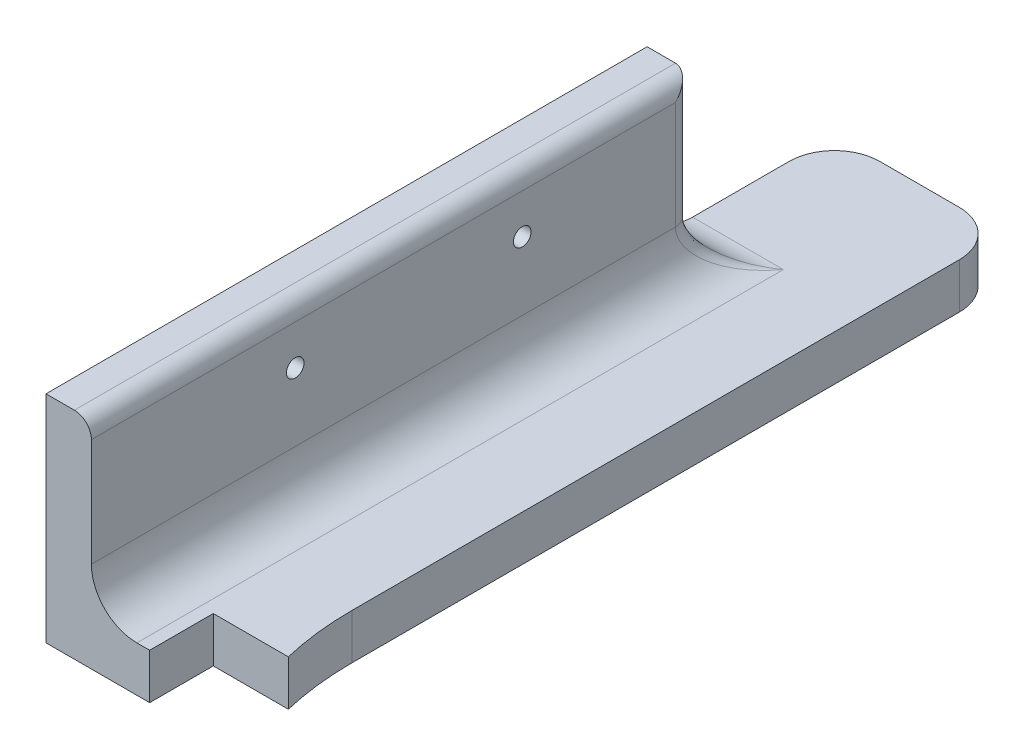
ISO-10303-21;
HEADER;
FILE_DESCRIPTION(('STEP AP214'),'2;1');
FILE_NAME('part.step','',(''),(''),'','','');
FILE_SCHEMA(('AUTOMOTIVE_DESIGN { 1 0 10303 214 1 1 1 1 }'));
ENDSEC;
DATA;
#1=APPLICATION_CONTEXT('core data for automotive mechanical design processes');
#2=APPLICATION_PROTOCOL_DEFINITION('international standard','automotive_design',2000,#1);
#3=PRODUCT_CONTEXT('',#1,'mechanical');
#4=PRODUCT('Part','Part','',(#3));
#5=PRODUCT_RELATED_PRODUCT_CATEGORY('part','',(#4));
#6=PRODUCT_DEFINITION_FORMATION('','',#4);
#7=PRODUCT_DEFINITION_CONTEXT('part definition',#1,'design');
#8=PRODUCT_DEFINITION('design','',#6,#7);
#9=PRODUCT_DEFINITION_SHAPE('','',#8);
#10=(LENGTH_UNIT() NAMED_UNIT(*) SI_UNIT(.MILLI.,.METRE.));
#11=(NAMED_UNIT(*) PLANE_ANGLE_UNIT() SI_UNIT($,.RADIAN.));
#12=(NAMED_UNIT(*) SI_UNIT($,.STERADIAN.) SOLID_ANGLE_UNIT());
#13=UNCERTAINTY_MEASURE_WITH_UNIT(LENGTH_MEASURE(1.E-05),#10,'distance_accuracy_value','');
#14=(GEOMETRIC_REPRESENTATION_CONTEXT(3) GLOBAL_UNCERTAINTY_ASSIGNED_CONTEXT((#13)) GLOBAL_UNIT_ASSIGNED_CONTEXT((#10,
#11,#12)) REPRESENTATION_CONTEXT('',''));
#15=CARTESIAN_POINT('',(0.,0.,0.));
#16=DIRECTION('',(0.,0.,1.));
#17=DIRECTION('',(1.,0.,0.));
#18=AXIS2_PLACEMENT_3D('',#15,#16,#17);
#19=CARTESIAN_POINT('',(-11.7425866237553,-0.0100000000000031,-64.7941480597572));
#20=DIRECTION('',(0.,0.,1.));
#21=DIRECTION('',(1.,0.,0.));
#22=AXIS2_PLACEMENT_3D('',#19,#20,#21);
#23=PLANE('',#22);
#24=DIRECTION('',(0.,-1.,0.));
#25=VECTOR('',#24,1.);
#26=CARTESIAN_POINT('',(1.47737016907246,8.,-64.7941480597572));
#27=LINE('',#26,#25);
#28=CARTESIAN_POINT('',(1.47737016907246,0.,-64.7941480597572));
#29=VERTEX_POINT('',#28);
#30=CARTESIAN_POINT('',(1.47737016907246,8.,-64.7941480597572));
#31=VERTEX_POINT('',#30);
#32=EDGE_CURVE('E261',#29,#31,#27,.F.);
#33=ORIENTED_EDGE('',*,*,#32,.T.);
#34=DIRECTION('',(-1.,0.,0.));
#35=VECTOR('',#34,1.);
#36=CARTESIAN_POINT('',(55.,8.,-64.7941480597572));
#37=LINE('',#36,#35);
#38=CARTESIAN_POINT('',(-11.7425866237553,8.,-64.7941480597572));
#39=VERTEX_POINT('',#38);
#40=EDGE_CURVE('E255',#31,#39,#37,.T.);
#41=ORIENTED_EDGE('',*,*,#40,.T.);
#42=DIRECTION('',(0.,1.,0.));
#43=VECTOR('',#42,1.);
#44=CARTESIAN_POINT('',(-11.7425866237553,-0.0100000000000031,-64.7941480597572));
#45=LINE('',#44,#43);
#46=CARTESIAN_POINT('',(-11.7425866237553,0.,-64.7941480597572));
#47=VERTEX_POINT('',#46);
#48=EDGE_CURVE('E11',#47,#39,#45,.T.);
#49=ORIENTED_EDGE('',*,*,#48,.F.);
#50=DIRECTION('',(-1.,0.,0.));
#51=VECTOR('',#50,1.);
#52=CARTESIAN_POINT('',(55.,0.,-64.7941480597572));
#53=LINE('',#52,#51);
#54=EDGE_CURVE('E247',#29,#47,#53,.T.);
#55=ORIENTED_EDGE('',*,*,#54,.F.);
#56=EDGE_LOOP('',(#33,#41,#49,#55));
#57=FACE_BOUND('',#56,.T.);
#58=ADVANCED_FACE('F43',(#57),#23,.T.);
#59=CARTESIAN_POINT('',(-30.,-0.0100000000000031,-53.5798321691983));
#60=DIRECTION('',(0.,0.,1.));
#61=DIRECTION('',(1.,0.,0.));
#62=AXIS2_PLACEMENT_3D('',#59,#60,#61);
#63=PLANE('',#62);
#64=DIRECTION('',(-1.,0.,0.));
#65=VECTOR('',#64,1.);
#66=CARTESIAN_POINT('',(55.,0.,-53.5798321691983));
#67=LINE('',#66,#65);
#68=CARTESIAN_POINT('',(-11.7425866237553,0.,-53.5798321691983));
#69=VERTEX_POINT('',#68);
#70=CARTESIAN_POINT('',(-30.,0.,-53.5798321691983));
#71=VERTEX_POINT('',#70);
#72=EDGE_CURVE('E174',#69,#71,#67,.T.);
#73=ORIENTED_EDGE('',*,*,#72,.F.);
#74=DIRECTION('',(0.,1.,0.));
#75=VECTOR('',#74,1.);
#76=CARTESIAN_POINT('',(-11.7425866237553,-0.0100000000000031,-53.5798321691983));
#77=LINE('',#76,#75);
#78=CARTESIAN_POINT('',(-11.7425866237553,8.,-53.5798321691983));
#79=VERTEX_POINT('',#78);
#80=EDGE_CURVE('E52',#69,#79,#77,.T.);
#81=ORIENTED_EDGE('',*,*,#80,.T.);
#82=DIRECTION('',(-1.,0.,0.));
#83=VECTOR('',#82,1.);
#84=CARTESIAN_POINT('',(55.,8.,-53.5798321691983));
#85=LINE('',#84,#83);
#86=CARTESIAN_POINT('',(-14.,8.,-53.5798321691983));
#87=VERTEX_POINT('',#86);
#88=EDGE_CURVE('E158',#79,#87,#85,.T.);
#89=ORIENTED_EDGE('',*,*,#88,.T.);
#90=CARTESIAN_POINT('',(-14.,16.,-53.5798321691983));
#91=DIRECTION('',(0.,0.,1.));
#92=DIRECTION('',(1.,0.,0.));
#93=AXIS2_PLACEMENT_3D('',#90,#91,#92);
#94=CIRCLE('',#93,8.);
#95=CARTESIAN_POINT('',(-22.,16.,-53.5798321691983));
#96=VERTEX_POINT('',#95);
#97=EDGE_CURVE('E172',#87,#96,#94,.F.);
#98=ORIENTED_EDGE('',*,*,#97,.T.);
#99=DIRECTION('',(0.,1.,0.));
#100=VECTOR('',#99,1.);
#101=CARTESIAN_POINT('',(-22.,38.,-53.5798321691983));
#102=LINE('',#101,#100);
#103=CARTESIAN_POINT('',(-22.,35.,-53.5798321691983));
#104=VERTEX_POINT('',#103);
#105=EDGE_CURVE('E183',#96,#104,#102,.T.);
#106=ORIENTED_EDGE('',*,*,#105,.T.);
#107=CARTESIAN_POINT('',(-25.,35.,-53.5798321691983));
#108=DIRECTION('',(0.,0.,1.));
#109=DIRECTION('',(1.,0.,0.));
#110=AXIS2_PLACEMENT_3D('',#107,#108,#109);
#111=CIRCLE('',#110,3.);
#112=CARTESIAN_POINT('',(-25.,38.,-53.5798321691983));
#113=VERTEX_POINT('',#112);
#114=EDGE_CURVE('E190',#113,#104,#111,.F.);
#115=ORIENTED_EDGE('',*,*,#114,.F.);
#116=DIRECTION('',(-1.,0.,0.));
#117=VECTOR('',#116,1.);
#118=CARTESIAN_POINT('',(0.,38.,-53.5798321691983));
#119=LINE('',#118,#117);
#120=CARTESIAN_POINT('',(-30.,38.,-53.5798321691982));
#121=VERTEX_POINT('',#120);
#122=EDGE_CURVE('E180',#113,#121,#119,.T.);
#123=ORIENTED_EDGE('',*,*,#122,.T.);
#124=DIRECTION('',(0.,-1.,0.));
#125=VECTOR('',#124,1.);
#126=CARTESIAN_POINT('',(-30.,8.,-53.5798321691983));
#127=LINE('',#126,#125);
#128=EDGE_CURVE('E258',#121,#71,#127,.T.);
#129=ORIENTED_EDGE('',*,*,#128,.T.);
#130=EDGE_LOOP('',(#73,#81,#89,#98,#106,#115,#123,#129));
#131=FACE_BOUND('',#130,.T.);
#132=ADVANCED_FACE('F170',(#131),#63,.T.);
#133=CARTESIAN_POINT('',(-11.7425866237553,-0.0100000000000031,-53.5798321691983));
#134=DIRECTION('',(1.,0.,0.));
#135=DIRECTION('',(0.,0.,-1.));
#136=AXIS2_PLACEMENT_3D('',#133,#134,#135);
#137=PLANE('',#136);
#138=ORIENTED_EDGE('',*,*,#48,.T.);
#139=DIRECTION('',(0.,0.,1.));
#140=VECTOR('',#139,1.);
#141=CARTESIAN_POINT('',(-11.7425866237553,8.,-77.4562211910223));
#142=LINE('',#141,#140);
#143=EDGE_CURVE('E175',#39,#79,#142,.T.);
#144=ORIENTED_EDGE('',*,*,#143,.T.);
#145=ORIENTED_EDGE('',*,*,#80,.F.);
#146=DIRECTION('',(0.,0.,1.));
#147=VECTOR('',#146,1.);
#148=CARTESIAN_POINT('',(-11.7425866237553,0.,-77.4562211910223));
#149=LINE('',#148,#147);
#150=EDGE_CURVE('E250',#47,#69,#149,.T.);
#151=ORIENTED_EDGE('',*,*,#150,.F.);
#152=EDGE_LOOP('',(#138,#144,#145,#151));
#153=FACE_BOUND('',#152,.T.);
#154=ADVANCED_FACE('F320',(#153),#137,.T.);
#155=CARTESIAN_POINT('',(-30.,16.,-167.484069150193));
#156=DIRECTION('',(1.,0.,0.));
#157=DIRECTION('',(0.,0.,-1.));
#158=AXIS2_PLACEMENT_3D('',#155,#156,#157);
#159=CYLINDRICAL_SURFACE('',#158,8.);
#160=DIRECTION('',(-1.,0.,0.));
#161=VECTOR('',#160,1.);
#162=CARTESIAN_POINT('',(-30.,16.,-159.484069150193));
#163=LINE('',#162,#161);
#164=CARTESIAN_POINT('',(-25.,16.,-159.484069150193));
#165=VERTEX_POINT('',#164);
#166=CARTESIAN_POINT('',(-30.,16.,-159.484069150193));
#167=VERTEX_POINT('',#166);
#168=EDGE_CURVE('E165',#165,#167,#163,.T.);
#169=ORIENTED_EDGE('',*,*,#168,.F.);
#170=CARTESIAN_POINT('',(-14.,16.,-167.484069150193));
#171=DIRECTION('',(-0.588171697675047,0.,-0.808736084303188));
#172=DIRECTION('',(0.808736084303188,0.,-0.588171697675047));
#173=AXIS2_PLACEMENT_3D('',#170,#171,#172);
#174=ELLIPSE('',#173,13.6014705087354,8.);
#175=CARTESIAN_POINT('',(-14.,8.,-167.484069150193));
#176=VERTEX_POINT('',#175);
#177=EDGE_CURVE('E360',#165,#176,#174,.F.);
#178=ORIENTED_EDGE('',*,*,#177,.T.);
#179=DIRECTION('',(-1.,0.,0.));
#180=VECTOR('',#179,1.);
#181=CARTESIAN_POINT('',(-22.,8.,-167.484069150193));
#182=LINE('',#181,#180);
#183=CARTESIAN_POINT('',(-30.,8.,-167.484069150193));
#184=VERTEX_POINT('',#183);
#185=EDGE_CURVE('E161',#184,#176,#182,.F.);
#186=ORIENTED_EDGE('',*,*,#185,.F.);
#187=CARTESIAN_POINT('',(-30.,16.,-167.484069150193));
#188=DIRECTION('',(1.,0.,0.));
#189=DIRECTION('',(0.,0.,-1.));
#190=AXIS2_PLACEMENT_3D('',#187,#188,#189);
#191=CIRCLE('',#190,8.);
#192=EDGE_CURVE('E195',#167,#184,#191,.T.);
#193=ORIENTED_EDGE('',*,*,#192,.F.);
#194=EDGE_LOOP('',(#169,#178,#186,#193));
#195=FACE_BOUND('',#194,.T.);
#196=ADVANCED_FACE('F290',(#195),#159,.F.);
#197=CARTESIAN_POINT('',(55.,8.,-77.4562211910223));
#198=DIRECTION('',(0.,-1.,0.));
#199=DIRECTION('',(0.,0.,-1.));
#200=AXIS2_PLACEMENT_3D('',#197,#198,#199);
#201=CYLINDRICAL_SURFACE('',#200,55.);
#202=ORIENTED_EDGE('',*,*,#32,.F.);
#203=CARTESIAN_POINT('',(55.,0.,-77.4562211910223));
#204=DIRECTION('',(0.,-1.,0.));
#205=DIRECTION('',(0.,0.,-1.));
#206=AXIS2_PLACEMENT_3D('',#203,#204,#205);
#207=CIRCLE('',#206,55.);
#208=CARTESIAN_POINT('',(0.,0.,-77.4562211910223));
#209=VERTEX_POINT('',#208);
#210=EDGE_CURVE('E69',#29,#209,#207,.T.);
#211=ORIENTED_EDGE('',*,*,#210,.T.);
#212=DIRECTION('',(0.,-1.,0.));
#213=VECTOR('',#212,1.);
#214=CARTESIAN_POINT('',(0.,8.,-77.4562211910223));
#215=LINE('',#214,#213);
#216=CARTESIAN_POINT('',(0.,8.,-77.4562211910223));
#217=VERTEX_POINT('',#216);
#218=EDGE_CURVE('E200',#217,#209,#215,.T.);
#219=ORIENTED_EDGE('',*,*,#218,.F.);
#220=CARTESIAN_POINT('',(55.,8.,-77.4562211910223));
#221=DIRECTION('',(0.,-1.,0.));
#222=DIRECTION('',(0.,0.,-1.));
#223=AXIS2_PLACEMENT_3D('',#220,#221,#222);
#224=CIRCLE('',#223,55.);
#225=EDGE_CURVE('E197',#31,#217,#224,.T.);
#226=ORIENTED_EDGE('',*,*,#225,.F.);
#227=EDGE_LOOP('',(#202,#211,#219,#226));
#228=FACE_BOUND('',#227,.T.);
#229=ADVANCED_FACE('F306',(#228),#201,.F.);
#230=CARTESIAN_POINT('',(0.,8.,-192.484069150193));
#231=DIRECTION('',(-1.,0.,0.));
#232=DIRECTION('',(0.,0.,1.));
#233=AXIS2_PLACEMENT_3D('',#230,#231,#232);
#234=PLANE('',#233);
#235=DIRECTION('',(0.,0.,-1.));
#236=VECTOR('',#235,1.);
#237=CARTESIAN_POINT('',(0.,0.,-192.484069150193));
#238=LINE('',#237,#236);
#239=CARTESIAN_POINT('',(0.,0.,-184.484069150193));
#240=VERTEX_POINT('',#239);
#241=EDGE_CURVE('E212',#209,#240,#238,.T.);
#242=ORIENTED_EDGE('',*,*,#241,.T.);
#243=DIRECTION('',(0.,-1.,0.));
#244=VECTOR('',#243,1.);
#245=CARTESIAN_POINT('',(0.,8.,-184.484069150193));
#246=LINE('',#245,#244);
#247=CARTESIAN_POINT('',(0.,8.,-184.484069150193));
#248=VERTEX_POINT('',#247);
#249=EDGE_CURVE('E361',#240,#248,#246,.F.);
#250=ORIENTED_EDGE('',*,*,#249,.T.);
#251=DIRECTION('',(0.,0.,-1.));
#252=VECTOR('',#251,1.);
#253=CARTESIAN_POINT('',(0.,8.,-192.484069150193));
#254=LINE('',#253,#252);
#255=EDGE_CURVE('E204',#217,#248,#254,.T.);
#256=ORIENTED_EDGE('',*,*,#255,.F.);
#257=ORIENTED_EDGE('',*,*,#218,.T.);
#258=EDGE_LOOP('',(#242,#250,#256,#257));
#259=FACE_BOUND('',#258,.T.);
#260=ADVANCED_FACE('F309',(#259),#234,.F.);
#261=CARTESIAN_POINT('',(-8.,8.,-184.484069150193));
#262=DIRECTION('',(0.,-1.,0.));
#263=DIRECTION('',(0.,0.,-1.));
#264=AXIS2_PLACEMENT_3D('',#261,#262,#263);
#265=CYLINDRICAL_SURFACE('',#264,8.);
#266=CARTESIAN_POINT('',(-8.,8.,-184.484069150193));
#267=DIRECTION('',(0.,-1.,0.));
#268=DIRECTION('',(0.,0.,-1.));
#269=AXIS2_PLACEMENT_3D('',#266,#267,#268);
#270=CIRCLE('',#269,8.);
#271=CARTESIAN_POINT('',(-8.,8.,-192.484069150193));
#272=VERTEX_POINT('',#271);
#273=EDGE_CURVE('E373',#248,#272,#270,.F.);
#274=ORIENTED_EDGE('',*,*,#273,.F.);
#275=ORIENTED_EDGE('',*,*,#249,.F.);
#276=CARTESIAN_POINT('',(-8.,0.,-184.484069150193));
#277=DIRECTION('',(0.,-1.,0.));
#278=DIRECTION('',(0.,0.,-1.));
#279=AXIS2_PLACEMENT_3D('',#276,#277,#278);
#280=CIRCLE('',#279,8.);
#281=CARTESIAN_POINT('',(-8.,0.,-192.484069150193));
#282=VERTEX_POINT('',#281);
#283=EDGE_CURVE('E381',#282,#240,#280,.T.);
#284=ORIENTED_EDGE('',*,*,#283,.F.);
#285=DIRECTION('',(0.,-1.,0.));
#286=VECTOR('',#285,1.);
#287=CARTESIAN_POINT('',(-8.,8.,-192.484069150193));
#288=LINE('',#287,#286);
#289=EDGE_CURVE('E377',#272,#282,#288,.T.);
#290=ORIENTED_EDGE('',*,*,#289,.F.);
#291=EDGE_LOOP('',(#274,#275,#284,#290));
#292=FACE_BOUND('',#291,.T.);
#293=ADVANCED_FACE('F341',(#292),#265,.T.);
#294=CARTESIAN_POINT('',(0.,8.,-192.484069150193));
#295=DIRECTION('',(0.,0.,1.));
#296=DIRECTION('',(1.,0.,0.));
#297=AXIS2_PLACEMENT_3D('',#294,#295,#296);
#298=PLANE('',#297);
#299=DIRECTION('',(-1.,0.,0.));
#300=VECTOR('',#299,1.);
#301=CARTESIAN_POINT('',(0.,0.,-192.484069150193));
#302=LINE('',#301,#300);
#303=CARTESIAN_POINT('',(-22.,0.,-192.484069150193));
#304=VERTEX_POINT('',#303);
#305=EDGE_CURVE('E206',#282,#304,#302,.T.);
#306=ORIENTED_EDGE('',*,*,#305,.T.);
#307=DIRECTION('',(0.,-1.,0.));
#308=VECTOR('',#307,1.);
#309=CARTESIAN_POINT('',(-22.,8.,-192.484069150193));
#310=LINE('',#309,#308);
#311=CARTESIAN_POINT('',(-22.,8.,-192.484069150193));
#312=VERTEX_POINT('',#311);
#313=EDGE_CURVE('E375',#304,#312,#310,.F.);
#314=ORIENTED_EDGE('',*,*,#313,.T.);
#315=DIRECTION('',(-1.,0.,0.));
#316=VECTOR('',#315,1.);
#317=CARTESIAN_POINT('',(0.,8.,-192.484069150193));
#318=LINE('',#317,#316);
#319=EDGE_CURVE('E202',#272,#312,#318,.T.);
#320=ORIENTED_EDGE('',*,*,#319,.F.);
#321=ORIENTED_EDGE('',*,*,#289,.T.);
#322=EDGE_LOOP('',(#306,#314,#320,#321));
#323=FACE_BOUND('',#322,.T.);
#324=ADVANCED_FACE('F338',(#323),#298,.F.);
#325=CARTESIAN_POINT('',(-22.,8.,-184.484069150193));
#326=DIRECTION('',(0.,-1.,0.));
#327=DIRECTION('',(0.,0.,-1.));
#328=AXIS2_PLACEMENT_3D('',#325,#326,#327);
#329=CYLINDRICAL_SURFACE('',#328,8.);
#330=CARTESIAN_POINT('',(-22.,8.,-184.484069150193));
#331=DIRECTION('',(0.,-1.,0.));
#332=DIRECTION('',(0.,0.,-1.));
#333=AXIS2_PLACEMENT_3D('',#330,#331,#332);
#334=CIRCLE('',#333,8.);
#335=CARTESIAN_POINT('',(-30.,8.,-184.484069150193));
#336=VERTEX_POINT('',#335);
#337=EDGE_CURVE('E371',#312,#336,#334,.F.);
#338=ORIENTED_EDGE('',*,*,#337,.F.);
#339=ORIENTED_EDGE('',*,*,#313,.F.);
#340=CARTESIAN_POINT('',(-22.,0.,-184.484069150193));
#341=DIRECTION('',(0.,-1.,0.));
#342=DIRECTION('',(0.,0.,-1.));
#343=AXIS2_PLACEMENT_3D('',#340,#341,#342);
#344=CIRCLE('',#343,8.);
#345=CARTESIAN_POINT('',(-30.,0.,-184.484069150193));
#346=VERTEX_POINT('',#345);
#347=EDGE_CURVE('E379',#346,#304,#344,.T.);
#348=ORIENTED_EDGE('',*,*,#347,.F.);
#349=DIRECTION('',(0.,-1.,0.));
#350=VECTOR('',#349,1.);
#351=CARTESIAN_POINT('',(-30.,8.,-184.484069150193));
#352=LINE('',#351,#350);
#353=EDGE_CURVE('E382',#336,#346,#352,.T.);
#354=ORIENTED_EDGE('',*,*,#353,.F.);
#355=EDGE_LOOP('',(#338,#339,#348,#354));
#356=FACE_BOUND('',#355,.T.);
#357=ADVANCED_FACE('F330',(#356),#329,.T.);
#358=CARTESIAN_POINT('',(-30.,28.,-89.4840691501934));
#359=DIRECTION('',(1.,0.,0.));
#360=DIRECTION('',(0.,0.,-1.));
#361=AXIS2_PLACEMENT_3D('',#358,#359,#360);
#362=CYLINDRICAL_SURFACE('',#361,1.54999999999999);
#363=CARTESIAN_POINT('',(-30.,28.,-89.4840691501934));
#364=DIRECTION('',(1.,0.,0.));
#365=DIRECTION('',(0.,0.,-1.));
#366=AXIS2_PLACEMENT_3D('',#363,#364,#365);
#367=CIRCLE('',#366,1.54999999999999);
#368=CARTESIAN_POINT('',(-30.,28.,-91.0340691501934));
#369=VERTEX_POINT('',#368);
#370=EDGE_CURVE('E238',#369,#369,#367,.T.);
#371=ORIENTED_EDGE('',*,*,#370,.F.);
#372=EDGE_LOOP('',(#371));
#373=FACE_BOUND('',#372,.T.);
#374=CARTESIAN_POINT('',(-22.,28.,-89.4840691501934));
#375=DIRECTION('',(1.,0.,0.));
#376=DIRECTION('',(0.,0.,-1.));
#377=AXIS2_PLACEMENT_3D('',#374,#375,#376);
#378=CIRCLE('',#377,1.54999999999999);
#379=CARTESIAN_POINT('',(-22.,28.,-91.0340691501934));
#380=VERTEX_POINT('',#379);
#381=EDGE_CURVE('E241',#380,#380,#378,.T.);
#382=ORIENTED_EDGE('',*,*,#381,.T.);
#383=EDGE_LOOP('',(#382));
#384=FACE_BOUND('',#383,.T.);
#385=ADVANCED_FACE('F327',(#373,#384),#362,.F.);
#386=CARTESIAN_POINT('',(-30.,28.,-129.484069150193));
#387=DIRECTION('',(1.,0.,0.));
#388=DIRECTION('',(0.,0.,-1.));
#389=AXIS2_PLACEMENT_3D('',#386,#387,#388);
#390=CYLINDRICAL_SURFACE('',#389,1.54999999999999);
#391=CARTESIAN_POINT('',(-30.,28.,-129.484069150193));
#392=DIRECTION('',(1.,0.,0.));
#393=DIRECTION('',(0.,0.,-1.));
#394=AXIS2_PLACEMENT_3D('',#391,#392,#393);
#395=CIRCLE('',#394,1.54999999999999);
#396=CARTESIAN_POINT('',(-30.,28.,-131.034069150193));
#397=VERTEX_POINT('',#396);
#398=EDGE_CURVE('E231',#397,#397,#395,.T.);
#399=ORIENTED_EDGE('',*,*,#398,.F.);
#400=EDGE_LOOP('',(#399));
#401=FACE_BOUND('',#400,.T.);
#402=CARTESIAN_POINT('',(-22.,28.,-129.484069150193));
#403=DIRECTION('',(1.,0.,0.));
#404=DIRECTION('',(0.,0.,-1.));
#405=AXIS2_PLACEMENT_3D('',#402,#403,#404);
#406=CIRCLE('',#405,1.54999999999999);
#407=CARTESIAN_POINT('',(-22.,28.,-131.034069150193));
#408=VERTEX_POINT('',#407);
#409=EDGE_CURVE('E235',#408,#408,#406,.T.);
#410=ORIENTED_EDGE('',*,*,#409,.T.);
#411=EDGE_LOOP('',(#410));
#412=FACE_BOUND('',#411,.T.);
#413=ADVANCED_FACE('F314',(#401,#412),#390,.F.);
#414=CARTESIAN_POINT('',(-30.,8.,-192.484069150193));
#415=DIRECTION('',(1.,0.,0.));
#416=DIRECTION('',(0.,0.,-1.));
#417=AXIS2_PLACEMENT_3D('',#414,#415,#416);
#418=PLANE('',#417);
#419=ORIENTED_EDGE('',*,*,#398,.T.);
#420=EDGE_LOOP('',(#419));
#421=FACE_BOUND('',#420,.T.);
#422=ORIENTED_EDGE('',*,*,#370,.T.);
#423=EDGE_LOOP('',(#422));
#424=FACE_BOUND('',#423,.T.);
#425=ORIENTED_EDGE('',*,*,#128,.F.);
#426=DIRECTION('',(0.,0.,1.));
#427=VECTOR('',#426,1.);
#428=CARTESIAN_POINT('',(-30.,38.,20.5159308498065));
#429=LINE('',#428,#427);
#430=CARTESIAN_POINT('',(-30.,38.,-159.484069150193));
#431=VERTEX_POINT('',#430);
#432=EDGE_CURVE('E47',#431,#121,#429,.T.);
#433=ORIENTED_EDGE('',*,*,#432,.F.);
#434=DIRECTION('',(0.,-1.,0.));
#435=VECTOR('',#434,1.);
#436=CARTESIAN_POINT('',(-30.,38.,-159.484069150193));
#437=LINE('',#436,#435);
#438=EDGE_CURVE('E219',#431,#167,#437,.T.);
#439=ORIENTED_EDGE('',*,*,#438,.T.);
#440=ORIENTED_EDGE('',*,*,#192,.T.);
#441=DIRECTION('',(0.,0.,1.));
#442=VECTOR('',#441,1.);
#443=CARTESIAN_POINT('',(-30.,8.,-192.484069150193));
#444=LINE('',#443,#442);
#445=EDGE_CURVE('E199',#336,#184,#444,.T.);
#446=ORIENTED_EDGE('',*,*,#445,.F.);
#447=ORIENTED_EDGE('',*,*,#353,.T.);
#448=DIRECTION('',(0.,0.,1.));
#449=VECTOR('',#448,1.);
#450=CARTESIAN_POINT('',(-30.,0.,-192.484069150193));
#451=LINE('',#450,#449);
#452=EDGE_CURVE('E203',#346,#71,#451,.T.);
#453=ORIENTED_EDGE('',*,*,#452,.T.);
#454=EDGE_LOOP('',(#425,#433,#439,#440,#446,#447,#453));
#455=FACE_BOUND('',#454,.T.);
#456=ADVANCED_FACE('F310',(#421,#424,#455),#418,.F.);
#457=CARTESIAN_POINT('',(-30.,38.,-159.484069150193));
#458=DIRECTION('',(0.,0.,1.));
#459=DIRECTION('',(1.,0.,0.));
#460=AXIS2_PLACEMENT_3D('',#457,#458,#459);
#461=PLANE('',#460);
#462=DIRECTION('',(-1.,0.,0.));
#463=VECTOR('',#462,1.);
#464=CARTESIAN_POINT('',(-30.,38.,-159.484069150193));
#465=LINE('',#464,#463);
#466=CARTESIAN_POINT('',(-25.,38.,-159.484069150193));
#467=VERTEX_POINT('',#466);
#468=EDGE_CURVE('E60',#467,#431,#465,.T.);
#469=ORIENTED_EDGE('',*,*,#468,.F.);
#470=DIRECTION('',(0.,-1.,0.));
#471=VECTOR('',#470,1.);
#472=CARTESIAN_POINT('',(-25.,38.,-159.484069150193));
#473=LINE('',#472,#471);
#474=EDGE_CURVE('E194',#467,#165,#473,.T.);
#475=ORIENTED_EDGE('',*,*,#474,.T.);
#476=ORIENTED_EDGE('',*,*,#168,.T.);
#477=ORIENTED_EDGE('',*,*,#438,.F.);
#478=EDGE_LOOP('',(#469,#475,#476,#477));
#479=FACE_BOUND('',#478,.T.);
#480=ADVANCED_FACE('F313',(#479),#461,.F.);
#481=CARTESIAN_POINT('',(-25.,38.,-156.484069150193));
#482=DIRECTION('',(0.,-1.,0.));
#483=DIRECTION('',(0.,0.,-1.));
#484=AXIS2_PLACEMENT_3D('',#481,#482,#483);
#485=CYLINDRICAL_SURFACE('',#484,3.);
#486=CARTESIAN_POINT('',(-25.,35.,-156.484069150193));
#487=DIRECTION('',(0.,-0.707106781186547,-0.707106781186547));
#488=DIRECTION('',(0.,0.707106781186547,-0.707106781186547));
#489=AXIS2_PLACEMENT_3D('',#486,#487,#488);
#490=ELLIPSE('',#489,4.24264068711928,3.);
#491=CARTESIAN_POINT('',(-22.,35.,-156.484069150193));
#492=VERTEX_POINT('',#491);
#493=EDGE_CURVE('E234',#467,#492,#490,.T.);
#494=ORIENTED_EDGE('',*,*,#493,.T.);
#495=DIRECTION('',(0.,-1.,0.));
#496=VECTOR('',#495,1.);
#497=CARTESIAN_POINT('',(-22.,38.,-156.484069150193));
#498=LINE('',#497,#496);
#499=CARTESIAN_POINT('',(-22.,16.,-156.484069150193));
#500=VERTEX_POINT('',#499);
#501=EDGE_CURVE('E189',#500,#492,#498,.F.);
#502=ORIENTED_EDGE('',*,*,#501,.F.);
#503=CARTESIAN_POINT('',(-25.,16.,-156.484069150193));
#504=DIRECTION('',(0.,-1.,0.));
#505=DIRECTION('',(0.,0.,-1.));
#506=AXIS2_PLACEMENT_3D('',#503,#504,#505);
#507=CIRCLE('',#506,3.);
#508=EDGE_CURVE('E245',#165,#500,#507,.T.);
#509=ORIENTED_EDGE('',*,*,#508,.F.);
#510=ORIENTED_EDGE('',*,*,#474,.F.);
#511=EDGE_LOOP('',(#494,#502,#509,#510));
#512=FACE_BOUND('',#511,.T.);
#513=ADVANCED_FACE('F274',(#512),#485,.T.);
#514=CARTESIAN_POINT('',(-22.,38.,-159.484069150193));
#515=DIRECTION('',(-1.,0.,0.));
#516=DIRECTION('',(0.,0.,1.));
#517=AXIS2_PLACEMENT_3D('',#514,#515,#516);
#518=PLANE('',#517);
#519=ORIENTED_EDGE('',*,*,#409,.F.);
#520=EDGE_LOOP('',(#519));
#521=FACE_BOUND('',#520,.T.);
#522=ORIENTED_EDGE('',*,*,#381,.F.);
#523=EDGE_LOOP('',(#522));
#524=FACE_BOUND('',#523,.T.);
#525=ORIENTED_EDGE('',*,*,#105,.F.);
#526=DIRECTION('',(0.,0.,-1.));
#527=VECTOR('',#526,1.);
#528=CARTESIAN_POINT('',(-22.,16.,-159.484069150193));
#529=LINE('',#528,#527);
#530=EDGE_CURVE('E178',#96,#500,#529,.T.);
#531=ORIENTED_EDGE('',*,*,#530,.T.);
#532=ORIENTED_EDGE('',*,*,#501,.T.);
#533=DIRECTION('',(0.,0.,-1.));
#534=VECTOR('',#533,1.);
#535=CARTESIAN_POINT('',(-22.,35.,-159.484069150193));
#536=LINE('',#535,#534);
#537=EDGE_CURVE('E191',#492,#104,#536,.F.);
#538=ORIENTED_EDGE('',*,*,#537,.T.);
#539=EDGE_LOOP('',(#525,#531,#532,#538));
#540=FACE_BOUND('',#539,.T.);
#541=ADVANCED_FACE('F266',(#521,#524,#540),#518,.F.);
#542=CARTESIAN_POINT('',(0.,38.,0.));
#543=DIRECTION('',(0.,-1.,0.));
#544=DIRECTION('',(0.,0.,-1.));
#545=AXIS2_PLACEMENT_3D('',#542,#543,#544);
#546=PLANE('',#545);
#547=ORIENTED_EDGE('',*,*,#122,.F.);
#548=DIRECTION('',(0.,0.,-1.));
#549=VECTOR('',#548,1.);
#550=CARTESIAN_POINT('',(-25.,38.,0.));
#551=LINE('',#550,#549);
#552=EDGE_CURVE('E187',#113,#467,#551,.T.);
#553=ORIENTED_EDGE('',*,*,#552,.T.);
#554=ORIENTED_EDGE('',*,*,#468,.T.);
#555=ORIENTED_EDGE('',*,*,#432,.T.);
#556=EDGE_LOOP('',(#547,#553,#554,#555));
#557=FACE_BOUND('',#556,.T.);
#558=ADVANCED_FACE('F297',(#557),#546,.F.);
#559=CARTESIAN_POINT('',(-25.,35.,0.));
#560=DIRECTION('',(0.,0.,-1.));
#561=DIRECTION('',(-1.,0.,0.));
#562=AXIS2_PLACEMENT_3D('',#559,#560,#561);
#563=CYLINDRICAL_SURFACE('',#562,3.);
#564=ORIENTED_EDGE('',*,*,#552,.F.);
#565=ORIENTED_EDGE('',*,*,#114,.T.);
#566=ORIENTED_EDGE('',*,*,#537,.F.);
#567=ORIENTED_EDGE('',*,*,#493,.F.);
#568=EDGE_LOOP('',(#564,#565,#566,#567));
#569=FACE_BOUND('',#568,.T.);
#570=ADVANCED_FACE('F45',(#569),#563,.T.);
#571=CARTESIAN_POINT('',(-14.,24.,-167.484069150193));
#572=CARTESIAN_POINT('',(-14.,24.,-167.484069150193));
#573=CARTESIAN_POINT('',(-14.,24.,-167.484069150193));
#574=CARTESIAN_POINT('',(-14.1742938927822,23.9999899619562,-167.244415047618));
#575=CARTESIAN_POINT('',(-14.2069737710404,24.0000198148153,-167.277095379153));
#576=CARTESIAN_POINT('',(-14.2396541025755,23.9999899619562,-167.309775257411));
#577=CARTESIAN_POINT('',(-14.3485626460554,23.9943042150284,-167.004795511867));
#578=CARTESIAN_POINT('',(-14.4140647462828,23.9921609522811,-167.070004403911));
#579=CARTESIAN_POINT('',(-14.4792736383262,23.9943042150284,-167.135506504138));
#580=CARTESIAN_POINT('',(-14.6967405015425,23.9715136887388,-166.526050960572));
#581=CARTESIAN_POINT('',(-14.8271077874044,23.9608300694683,-166.656961362789));
#582=CARTESIAN_POINT('',(-14.9580181896209,23.9715136887388,-166.787328648651));
#583=CARTESIAN_POINT('',(-14.8706495725402,23.9544079568025,-166.286925987951));
#584=CARTESIAN_POINT('',(-15.0333526216844,23.9373121220661,-166.450716528509));
#585=CARTESIAN_POINT('',(-15.1971431622428,23.9544079568025,-166.613419577653));
#586=CARTESIAN_POINT('',(-15.3882720668425,23.8862632644301,-165.575195058285));
#587=CARTESIAN_POINT('',(-15.6463697288112,23.8436747706663,-165.837699421382));
#588=CARTESIAN_POINT('',(-15.9088740919084,23.8862632644301,-166.095797083351));
#589=CARTESIAN_POINT('',(-15.7309626636212,23.8183972142882,-165.103995487714));
#590=CARTESIAN_POINT('',(-16.0510809019746,23.7501713189761,-165.432988248219));
#591=CARTESIAN_POINT('',(-16.3800736624791,23.8183972142882,-165.753106486572));
#592=CARTESIAN_POINT('',(-16.4044461355066,23.6379421875901,-164.177955713872));
#593=CARTESIAN_POINT('',(-16.8373545599593,23.5044939880067,-164.646714590234));
#594=CARTESIAN_POINT('',(-17.3061134363215,23.6379421875901,-165.079623014687));
#595=CARTESIAN_POINT('',(-16.7353421607257,23.5261224395318,-163.722973679196));
#596=CARTESIAN_POINT('',(-17.2212349282761,23.3519662395429,-164.262834221917));
#597=CARTESIAN_POINT('',(-17.7610954709978,23.5261224395318,-164.748726989468));
#598=CARTESIAN_POINT('',(-17.3795588580707,23.2592778467988,-162.837175720346));
#599=CARTESIAN_POINT('',(-17.9559886493718,22.9936301666897,-163.528080500822));
#600=CARTESIAN_POINT('',(-18.6468934298472,23.2592778467988,-164.104510292123));
#601=CARTESIAN_POINT('',(-17.693111683002,23.105385191681,-162.406040586066));
#602=CARTESIAN_POINT('',(-18.3091044136777,22.7873013169734,-163.174964736516));
#603=CARTESIAN_POINT('',(-19.0780285641278,23.105385191681,-163.790957467191));
#604=CARTESIAN_POINT('',(-18.2971200418087,22.7566609822828,-161.575529092707));
#605=CARTESIAN_POINT('',(-18.9730319588337,22.3292660121632,-162.51103719136));
#606=CARTESIAN_POINT('',(-19.9085400574869,22.7566609822828,-163.186949108385));
#607=CARTESIAN_POINT('',(-18.5879930869637,22.5632884326532,-161.175578655618));
#608=CARTESIAN_POINT('',(-19.2859489722586,22.0769032416591,-162.198120177935));
#609=CARTESIAN_POINT('',(-20.3084904945751,22.5632884326532,-162.89607606323));
#610=CARTESIAN_POINT('',(-19.1414718651126,22.1385891565879,-160.414545335664));
#611=CARTESIAN_POINT('',(-19.8614417920151,21.5375914055212,-161.622627358178));
#612=CARTESIAN_POINT('',(-21.0695238145299,22.1385891565879,-162.342597285081));
#613=CARTESIAN_POINT('',(-19.4047316954206,21.9089835782152,-160.05256306899));
#614=CARTESIAN_POINT('',(-20.1258990081334,21.2499208294343,-161.35817014206));
#615=CARTESIAN_POINT('',(-21.4315060812034,21.9089835782152,-162.079337454773));
#616=CARTESIAN_POINT('',(-19.8982358483195,21.4154661646287,-159.373994858754));
#617=CARTESIAN_POINT('',(-20.5986049852154,20.6538839628691,-160.885464164978));
#618=CARTESIAN_POINT('',(-22.1100742914392,21.4154661646287,-161.585833301874));
#619=CARTESIAN_POINT('',(-20.1294089005679,21.1534325691657,-159.056131911913));
#620=CARTESIAN_POINT('',(-20.8084106746225,20.3448609464651,-160.675658475571));
#621=CARTESIAN_POINT('',(-22.4279372382802,21.1534325691657,-161.354660249626));
#622=CARTESIAN_POINT('',(-20.5544720365022,20.5994859271787,-158.471670100002));
#623=CARTESIAN_POINT('',(-21.1695672470108,19.7227120691587,-160.314501903183));
#624=CARTESIAN_POINT('',(-23.0123990501911,20.5994859271787,-160.929597113691));
#625=CARTESIAN_POINT('',(-20.7495708717536,20.3094452974296,-158.20340920153));
#626=CARTESIAN_POINT('',(-21.3220581081108,19.4091963263343,-160.162011042083));
#627=CARTESIAN_POINT('',(-23.2806599486632,20.3094452974296,-160.73449827844));
#628=CARTESIAN_POINT('',(-21.098946446922,19.7042210834787,-157.723017785678));
#629=CARTESIAN_POINT('',(-21.5717164842712,18.795382482092,-159.912352665922));
#630=CARTESIAN_POINT('',(-23.7610513645159,19.7042210834787,-160.385122703271));
#631=CARTESIAN_POINT('',(-21.2546455245557,19.3907136314074,-157.508931553936));
#632=CARTESIAN_POINT('',(-21.669569571718,18.4952035259126,-159.814499578475));
#633=CARTESIAN_POINT('',(-23.9751375962572,19.3907136314074,-160.229423625638));
#634=CARTESIAN_POINT('',(-21.4566201289061,18.9031485107909,-157.231216472944));
#635=CARTESIAN_POINT('',(-21.7821392128155,18.0651613992032,-159.701929937378));
#636=CARTESIAN_POINT('',(-24.2528526772493,18.9031485107909,-160.027449021287));
#637=CARTESIAN_POINT('',(-21.5177395339151,18.7411904647365,-157.147177291051));
#638=CARTESIAN_POINT('',(-21.8137539868118,17.926639352417,-159.670315163382));
#639=CARTESIAN_POINT('',(-24.3368918591427,18.7411904647365,-159.966329616278));
#640=CARTESIAN_POINT('',(-21.6301568586956,18.4106281389662,-156.992603469479));
#641=CARTESIAN_POINT('',(-21.8680785123559,17.6545693837739,-159.615990637838));
#642=CARTESIAN_POINT('',(-24.4914656807143,18.4106281389662,-159.853912291498));
#643=CARTESIAN_POINT('',(-21.6814595248414,18.24202711891,-156.922062303536));
#644=CARTESIAN_POINT('',(-21.8906400522504,17.5213001187156,-159.593429097943));
#645=CARTESIAN_POINT('',(-24.562006846657,18.24202711891,-159.802609625352));
#646=CARTESIAN_POINT('',(-21.7720007639893,17.90412675111,-156.797568099708));
#647=CARTESIAN_POINT('',(-21.9276644560338,17.2644026228696,-159.55640469416));
#648=CARTESIAN_POINT('',(-24.6865010504852,17.90412675111,-159.712068386204));
#649=CARTESIAN_POINT('',(-21.8115500883001,17.7349941486565,-156.743187778774));
#650=CARTESIAN_POINT('',(-21.9422415846096,17.1408778337007,-159.541827565584));
#651=CARTESIAN_POINT('',(-24.7408813714194,17.7349941486565,-159.672519061893));
#652=CARTESIAN_POINT('',(-21.8798144532943,17.3924774882919,-156.649324276906));
#653=CARTESIAN_POINT('',(-21.9657660146241,16.8991388582726,-159.518303135569));
#654=CARTESIAN_POINT('',(-24.8347448732875,17.3924774882919,-159.604254696899));
#655=CARTESIAN_POINT('',(-21.9085347359846,17.2190955307639,-156.609833888213));
#656=CARTESIAN_POINT('',(-21.9746425781412,16.7812507429044,-159.509426572052));
#657=CARTESIAN_POINT('',(-24.8742352619808,17.2190955307639,-159.575534414209));
#658=CARTESIAN_POINT('',(-21.9542125295241,16.8721378995579,-156.5470269221));
#659=CARTESIAN_POINT('',(-21.9880539814028,16.5514740065999,-159.496015168791));
#660=CARTESIAN_POINT('',(-24.9370422280937,16.8721378995579,-159.529856620669));
#661=CARTESIAN_POINT('',(-21.9713518952505,16.698610243797,-156.523460294224));
#662=CARTESIAN_POINT('',(-21.9926165125774,16.4398316118385,-159.491452637616));
#663=CARTESIAN_POINT('',(-24.9606088559693,16.698610243797,-159.512717254943));
#664=CARTESIAN_POINT('',(-21.9942455292387,16.3500550408685,-156.491981547489));
#665=CARTESIAN_POINT('',(-21.9985981819088,16.2186338404074,-159.485470968285));
#666=CARTESIAN_POINT('',(-24.9920876027041,16.3500550408685,-159.489823620955));
#667=CARTESIAN_POINT('',(-22.,16.1750275204343,-156.484069150193));
#668=CARTESIAN_POINT('',(-22.,16.1093957228566,-159.484069150193));
#669=CARTESIAN_POINT('',(-25.,16.1750275204343,-159.484069150193));
#670=CARTESIAN_POINT('',(-22.,15.8249724795657,-156.484069150193));
#671=CARTESIAN_POINT('',(-22.,15.8906042771434,-159.484069150193));
#672=CARTESIAN_POINT('',(-25.,15.8249724795657,-159.484069150193));
#673=CARTESIAN_POINT('',(-21.9942455292387,15.6499449591315,-156.491981547489));
#674=CARTESIAN_POINT('',(-21.9985981819088,15.7813661595926,-159.485470968285));
#675=CARTESIAN_POINT('',(-24.9920876027041,15.6499449591315,-159.489823620955));
#676=CARTESIAN_POINT('',(-21.9713518952505,15.301389756203,-156.523460294224));
#677=CARTESIAN_POINT('',(-21.9926165125774,15.5601683881615,-159.491452637616));
#678=CARTESIAN_POINT('',(-24.9606088559693,15.301389756203,-159.512717254943));
#679=CARTESIAN_POINT('',(-21.9542125295241,15.1278621004421,-156.5470269221));
#680=CARTESIAN_POINT('',(-21.9880539814028,15.4485259934001,-159.496015168791));
#681=CARTESIAN_POINT('',(-24.9370422280937,15.1278621004421,-159.529856620669));
#682=CARTESIAN_POINT('',(-21.9085347359846,14.7809044692361,-156.609833888213));
#683=CARTESIAN_POINT('',(-21.9746425781412,15.2187492570956,-159.509426572052));
#684=CARTESIAN_POINT('',(-24.8742352619808,14.7809044692361,-159.575534414209));
#685=CARTESIAN_POINT('',(-21.8798144532943,14.6075225117081,-156.649324276906));
#686=CARTESIAN_POINT('',(-21.9657660146241,15.1008611417274,-159.518303135569));
#687=CARTESIAN_POINT('',(-24.8347448732875,14.6075225117081,-159.604254696899));
#688=CARTESIAN_POINT('',(-21.8115500883001,14.2650058513435,-156.743187778774));
#689=CARTESIAN_POINT('',(-21.9422415846096,14.8591221662993,-159.541827565584));
#690=CARTESIAN_POINT('',(-24.7408813714194,14.2650058513435,-159.672519061893));
#691=CARTESIAN_POINT('',(-21.7720007639893,14.09587324889,-156.797568099708));
#692=CARTESIAN_POINT('',(-21.9276644560338,14.7355973771304,-159.55640469416));
#693=CARTESIAN_POINT('',(-24.6865010504852,14.09587324889,-159.712068386204));
#694=CARTESIAN_POINT('',(-21.6814595248414,13.75797288109,-156.922062303536));
#695=CARTESIAN_POINT('',(-21.8906400522504,14.4786998812844,-159.593429097943));
#696=CARTESIAN_POINT('',(-24.562006846657,13.75797288109,-159.802609625352));
#697=CARTESIAN_POINT('',(-21.6301568586956,13.5893718610338,-156.992603469479));
#698=CARTESIAN_POINT('',(-21.8680785123559,14.3454306162261,-159.615990637838));
#699=CARTESIAN_POINT('',(-24.4914656807143,13.5893718610338,-159.853912291498));
#700=CARTESIAN_POINT('',(-21.5177395339151,13.2588095352635,-157.147177291051));
#701=CARTESIAN_POINT('',(-21.8137539868118,14.073360647583,-159.670315163382));
#702=CARTESIAN_POINT('',(-24.3368918591427,13.2588095352635,-159.966329616278));
#703=CARTESIAN_POINT('',(-21.4566201289061,13.0968514892091,-157.231216472944));
#704=CARTESIAN_POINT('',(-21.7821392128155,13.9348386007968,-159.701929937378));
#705=CARTESIAN_POINT('',(-24.2528526772493,13.0968514892091,-160.027449021287));
#706=CARTESIAN_POINT('',(-21.2546455245557,12.6092863685926,-157.508931553936));
#707=CARTESIAN_POINT('',(-21.669569571718,13.5047964740874,-159.814499578475));
#708=CARTESIAN_POINT('',(-23.9751375962572,12.6092863685926,-160.229423625638));
#709=CARTESIAN_POINT('',(-21.098946446922,12.2957789165213,-157.723017785678));
#710=CARTESIAN_POINT('',(-21.5717164842712,13.204617517908,-159.912352665922));
#711=CARTESIAN_POINT('',(-23.7610513645159,12.2957789165213,-160.385122703271));
#712=CARTESIAN_POINT('',(-20.7495708717536,11.6905547025704,-158.20340920153));
#713=CARTESIAN_POINT('',(-21.3220581081109,12.5908036736657,-160.162011042083));
#714=CARTESIAN_POINT('',(-23.2806599486632,11.6905547025704,-160.73449827844));
#715=CARTESIAN_POINT('',(-20.5544720365022,11.4005140728213,-158.471670100002));
#716=CARTESIAN_POINT('',(-21.1695672470108,12.2772879308413,-160.314501903183));
#717=CARTESIAN_POINT('',(-23.0123990501911,11.4005140728213,-160.929597113691));
#718=CARTESIAN_POINT('',(-20.1294089005679,10.8465674308343,-159.056131911913));
#719=CARTESIAN_POINT('',(-20.8084106746225,11.6551390535349,-160.675658475571));
#720=CARTESIAN_POINT('',(-22.4279372382802,10.8465674308343,-161.354660249626));
#721=CARTESIAN_POINT('',(-19.8982358483195,10.5845338353713,-159.373994858754));
#722=CARTESIAN_POINT('',(-20.5986049852154,11.3461160371309,-160.885464164978));
#723=CARTESIAN_POINT('',(-22.1100742914392,10.5845338353713,-161.585833301874));
#724=CARTESIAN_POINT('',(-19.4047316954206,10.0910164217848,-160.05256306899));
#725=CARTESIAN_POINT('',(-20.1258990081334,10.7500791705657,-161.35817014206));
#726=CARTESIAN_POINT('',(-21.4315060812034,10.0910164217848,-162.079337454773));
#727=CARTESIAN_POINT('',(-19.1414718651126,9.86141084341215,-160.414545335664));
#728=CARTESIAN_POINT('',(-19.8614417920151,10.4624085944788,-161.622627358178));
#729=CARTESIAN_POINT('',(-21.0695238145299,9.86141084341215,-162.342597285081));
#730=CARTESIAN_POINT('',(-18.5879930869637,9.43671156734683,-161.175578655618));
#731=CARTESIAN_POINT('',(-19.2859489722586,9.92309675834088,-162.198120177935));
#732=CARTESIAN_POINT('',(-20.3084904945751,9.43671156734683,-162.89607606323));
#733=CARTESIAN_POINT('',(-18.2971200418087,9.24333901771725,-161.575529092707));
#734=CARTESIAN_POINT('',(-18.9730319588337,9.67073398783685,-162.51103719136));
#735=CARTESIAN_POINT('',(-19.9085400574869,9.24333901771725,-163.186949108385));
#736=CARTESIAN_POINT('',(-17.693111683002,8.894614808319,-162.406040586066));
#737=CARTESIAN_POINT('',(-18.3091044136777,9.21269868302662,-163.174964736516));
#738=CARTESIAN_POINT('',(-19.0780285641278,8.894614808319,-163.790957467191));
#739=CARTESIAN_POINT('',(-17.3795588580707,8.74072215320118,-162.837175720346));
#740=CARTESIAN_POINT('',(-17.9559886493718,9.00636983331027,-163.528080500822));
#741=CARTESIAN_POINT('',(-18.6468934298472,8.74072215320118,-164.104510292123));
#742=CARTESIAN_POINT('',(-16.7353421607257,8.47387756046817,-163.722973679196));
#743=CARTESIAN_POINT('',(-17.2212349282761,8.64803376045714,-164.262834221917));
#744=CARTESIAN_POINT('',(-17.7610954709978,8.47387756046817,-164.748726989468));
#745=CARTESIAN_POINT('',(-16.4044461355066,8.36205781240994,-164.177955713872));
#746=CARTESIAN_POINT('',(-16.8373545599593,8.4955060119933,-164.646714590234));
#747=CARTESIAN_POINT('',(-17.3061134363215,8.36205781240994,-165.079623014687));
#748=CARTESIAN_POINT('',(-15.7309626636212,8.18160278571184,-165.103995487714));
#749=CARTESIAN_POINT('',(-16.0510809019746,8.24982868102388,-165.432988248219));
#750=CARTESIAN_POINT('',(-16.3800736624791,8.18160278571184,-165.753106486572));
#751=CARTESIAN_POINT('',(-15.3882720668425,8.11373673556986,-165.575195058285));
#752=CARTESIAN_POINT('',(-15.6463697288112,8.15632522933373,-165.837699421382));
#753=CARTESIAN_POINT('',(-15.9088740919084,8.11373673556986,-166.095797083351));
#754=CARTESIAN_POINT('',(-14.8706495725402,8.04559204319751,-166.286925987951));
#755=CARTESIAN_POINT('',(-15.0333526216844,8.06268787793389,-166.450716528509));
#756=CARTESIAN_POINT('',(-15.1971431622428,8.04559204319752,-166.613419577653));
#757=CARTESIAN_POINT('',(-14.6967405015425,8.02848631126124,-166.526050960572));
#758=CARTESIAN_POINT('',(-14.8271077874044,8.03916993053166,-166.656961362789));
#759=CARTESIAN_POINT('',(-14.9580181896209,8.02848631126124,-166.787328648651));
#760=CARTESIAN_POINT('',(-14.3485626460554,8.00569578497161,-167.004795511867));
#761=CARTESIAN_POINT('',(-14.4140647462828,8.00783904771889,-167.070004403911));
#762=CARTESIAN_POINT('',(-14.4792736383262,8.00569578497161,-167.135506504138));
#763=CARTESIAN_POINT('',(-14.1742938927822,8.0000100380438,-167.244415047618));
#764=CARTESIAN_POINT('',(-14.2069737710404,7.99998018518466,-167.277095379153));
#765=CARTESIAN_POINT('',(-14.2396541025755,8.00001003804381,-167.309775257411));
#766=CARTESIAN_POINT('',(-14.,8.,-167.484069150193));
#767=CARTESIAN_POINT('',(-14.,8.,-167.484069150193));
#768=CARTESIAN_POINT('',(-14.,8.,-167.484069150193));
#769=(BOUNDED_SURFACE() B_SPLINE_SURFACE(3,2,((#571,#572,#573),(#574,#575,#576),(#577,#578,
#579),(#580,#581,#582),(#583,#584,#585),(#586,#587,#588),(#589,#590,#591),(#592,#593,#594),
(#595,#596,#597),(#598,#599,#600),(#601,#602,#603),(#604,#605,#606),(#607,#608,#609),(#610,#611,
#612),(#613,#614,#615),(#616,#617,#618),(#619,#620,#621),(#622,#623,#624),(#625,#626,#627),
(#628,#629,#630),(#631,#632,#633),(#634,#635,#636),(#637,#638,#639),(#640,#641,#642),(#643,#644,
#645),(#646,#647,#648),(#649,#650,#651),(#652,#653,#654),(#655,#656,#657),(#658,#659,#660),
(#661,#662,#663),(#664,#665,#666),(#667,#668,#669),(#670,#671,#672),(#673,#674,#675),(#676,#677,
#678),(#679,#680,#681),(#682,#683,#684),(#685,#686,#687),(#688,#689,#690),(#691,#692,#693),
(#694,#695,#696),(#697,#698,#699),(#700,#701,#702),(#703,#704,#705),(#706,#707,#708),(#709,#710,
#711),(#712,#713,#714),(#715,#716,#717),(#718,#719,#720),(#721,#722,#723),(#724,#725,#726),
(#727,#728,#729),(#730,#731,#732),(#733,#734,#735),(#736,#737,#738),(#739,#740,#741),(#742,#743,
#744),(#745,#746,#747),(#748,#749,#750),(#751,#752,#753),(#754,#755,#756),(#757,#758,#759),
(#760,#761,#762),(#763,#764,#765),(#766,#767,#768)),.UNSPECIFIED.,.F.,.F.,
.F.) B_SPLINE_SURFACE_WITH_KNOTS((4,2,2,2,2,2,2,2,2,2,2,2,2,2,2,2,2,2,2,2,2,2,2,2,2,2,2,2,2,2,2,
2,4),(3,3),(0.,1.01657632639329,2.03323745899665,4.04865040321561,6.03025891798376,
7.96305170811308,9.83432357739883,11.6344992219487,13.3579835680868,15.0040006499646,
16.577322827091,17.3338592213356,18.0900289022862,18.8239328400925,19.5574810600314,
20.279224647026,21.0009553964873,21.7226861459485,22.4444297329431,23.1779779528821,
23.9118818906884,24.6680515716389,25.4245879658836,26.99791014301,28.6439272248878,
30.3674115710259,32.1675872155758,34.0388590848615,35.9716518749908,37.953260389759,
39.9686733339779,40.9853344665813,42.0019107929746),(0.,1.),
.UNSPECIFIED.) GEOMETRIC_REPRESENTATION_ITEM() RATIONAL_B_SPLINE_SURFACE(((1.,1.,1.),(1.,
0.999999961347463,1.),(1.,0.999643922983415,1.),(1.,0.998220838244432,1.),(1.,0.9971537325573,
1.),(1.,0.992912442828984,1.),(1.,0.988698139291651,1.),(1.,0.97761667849139,1.),(1.,
0.970795203041526,1.),(1.,0.954789243872561,1.),(1.,0.945667111065175,1.),(1.,0.925487928481901,
1.),(1.,0.914501709356371,1.),(1.,0.891170043426543,1.),(1.,0.878892097179545,1.),(1.,
0.853706858802364,1.),(1.,0.840848661884106,1.),(1.,0.815387916749463,1.),(1.,0.802799855389334,
1.),(1.,0.778879121395579,1.),(1.,0.767515558252507,1.),(1.,0.752114039788176,1.),(1.,
0.747335652878585,1.),(1.,0.738380806528765,1.),(1.,0.734204056441023,1.),(1.,0.726720755902299,
1.),(1.,0.723392203429006,1.),(1.,0.717584783984872,1.),(1.,0.715105505959655,1.),(1.,
0.711136412340237,1.),(1.,0.709631315866728,1.),(1.,0.70761650914203,1.),(1.,0.707106781186548,
1.),(1.,0.707106781186548,1.),(1.,0.70761650914203,1.),(1.,0.709631315866728,1.),(1.,
0.711136412340237,1.),(1.,0.715105505959655,1.),(1.,0.717584783984872,1.),(1.,0.723392203429005,
1.),(1.,0.726720755902299,1.),(1.,0.734204056441023,1.),(1.,0.738380806528765,1.),(1.,
0.747335652878585,1.),(1.,0.752114039788175,1.),(1.,0.767515558252507,1.),(1.,0.778879121395579,
1.),(1.,0.802799855389335,1.),(1.,0.815387916749463,1.),(1.,0.840848661884107,1.),(1.,
0.853706858802364,1.),(1.,0.878892097179545,1.),(1.,0.891170043426543,1.),(1.,0.914501709356371,
1.),(1.,0.925487928481901,1.),(1.,0.945667111065175,1.),(1.,0.954789243872561,1.),(1.,
0.970795203041526,1.),(1.,0.97761667849139,1.),(1.,0.988698139291651,1.),(1.,0.992912442828984,
1.),(1.,0.9971537325573,1.),(1.,0.998220838244432,1.),(1.,0.999643922983415,1.),(1.,
0.999999961347463,1.),(1.,1.,1.))) REPRESENTATION_ITEM('') SURFACE());
#770=ORIENTED_EDGE('',*,*,#508,.T.);
#771=CARTESIAN_POINT('',(-14.,16.,-167.484069150193));
#772=DIRECTION('',(-0.808736084303189,0.,-0.588171697675046));
#773=DIRECTION('',(0.588171697675046,0.,-0.808736084303189));
#774=AXIS2_PLACEMENT_3D('',#771,#772,#773);
#775=ELLIPSE('',#774,13.6014705087355,8.);
#776=EDGE_CURVE('E363',#176,#500,#775,.T.);
#777=ORIENTED_EDGE('',*,*,#776,.F.);
#778=ORIENTED_EDGE('',*,*,#177,.F.);
#779=EDGE_LOOP('',(#770,#777,#778));
#780=FACE_BOUND('',#779,.T.);
#781=ADVANCED_FACE('F283',(#780),#769,.T.);
#782=CARTESIAN_POINT('',(55.,8.,-77.4562211910223));
#783=DIRECTION('',(0.,-1.,0.));
#784=DIRECTION('',(0.,0.,-1.));
#785=AXIS2_PLACEMENT_3D('',#782,#783,#784);
#786=PLANE('',#785);
#787=ORIENTED_EDGE('',*,*,#88,.F.);
#788=ORIENTED_EDGE('',*,*,#143,.F.);
#789=ORIENTED_EDGE('',*,*,#40,.F.);
#790=ORIENTED_EDGE('',*,*,#225,.T.);
#791=ORIENTED_EDGE('',*,*,#255,.T.);
#792=ORIENTED_EDGE('',*,*,#273,.T.);
#793=ORIENTED_EDGE('',*,*,#319,.T.);
#794=ORIENTED_EDGE('',*,*,#337,.T.);
#795=ORIENTED_EDGE('',*,*,#445,.T.);
#796=ORIENTED_EDGE('',*,*,#185,.T.);
#797=DIRECTION('',(0.,0.,-1.));
#798=VECTOR('',#797,1.);
#799=CARTESIAN_POINT('',(-14.,8.,20.5159308498065));
#800=LINE('',#799,#798);
#801=EDGE_CURVE('E154',#176,#87,#800,.F.);
#802=ORIENTED_EDGE('',*,*,#801,.T.);
#803=EDGE_LOOP('',(#787,#788,#789,#790,#791,#792,#793,#794,#795,#796,#802));
#804=FACE_BOUND('',#803,.T.);
#805=ADVANCED_FACE('F156',(#804),#786,.F.);
#806=CARTESIAN_POINT('',(-14.,16.,-159.484069150193));
#807=DIRECTION('',(0.,0.,1.));
#808=DIRECTION('',(1.,0.,0.));
#809=AXIS2_PLACEMENT_3D('',#806,#807,#808);
#810=CYLINDRICAL_SURFACE('',#809,8.);
#811=ORIENTED_EDGE('',*,*,#97,.F.);
#812=ORIENTED_EDGE('',*,*,#801,.F.);
#813=ORIENTED_EDGE('',*,*,#776,.T.);
#814=ORIENTED_EDGE('',*,*,#530,.F.);
#815=EDGE_LOOP('',(#811,#812,#813,#814));
#816=FACE_BOUND('',#815,.T.);
#817=ADVANCED_FACE('F177',(#816),#810,.F.);
#818=CARTESIAN_POINT('',(55.,0.,-77.4562211910223));
#819=DIRECTION('',(0.,-1.,0.));
#820=DIRECTION('',(0.,0.,-1.));
#821=AXIS2_PLACEMENT_3D('',#818,#819,#820);
#822=PLANE('',#821);
#823=ORIENTED_EDGE('',*,*,#150,.T.);
#824=ORIENTED_EDGE('',*,*,#72,.T.);
#825=ORIENTED_EDGE('',*,*,#452,.F.);
#826=ORIENTED_EDGE('',*,*,#347,.T.);
#827=ORIENTED_EDGE('',*,*,#305,.F.);
#828=ORIENTED_EDGE('',*,*,#283,.T.);
#829=ORIENTED_EDGE('',*,*,#241,.F.);
#830=ORIENTED_EDGE('',*,*,#210,.F.);
#831=ORIENTED_EDGE('',*,*,#54,.T.);
#832=EDGE_LOOP('',(#823,#824,#825,#826,#827,#828,#829,#830,#831));
#833=FACE_BOUND('',#832,.T.);
#834=ADVANCED_FACE('F296',(#833),#822,.T.);
#835=CLOSED_SHELL('',(#58,#132,#154,#196,#229,#260,#293,#324,#357,#385,#413,#456,#480,#513,#541,
#558,#570,#781,#805,#817,#834));
#836=MANIFOLD_SOLID_BREP('B2',#835);
#837=ADVANCED_BREP_SHAPE_REPRESENTATION('',(#18,#836),#14);
#838=SHAPE_DEFINITION_REPRESENTATION(#9,#837);
ENDSEC;
END-ISO-10303-21;
